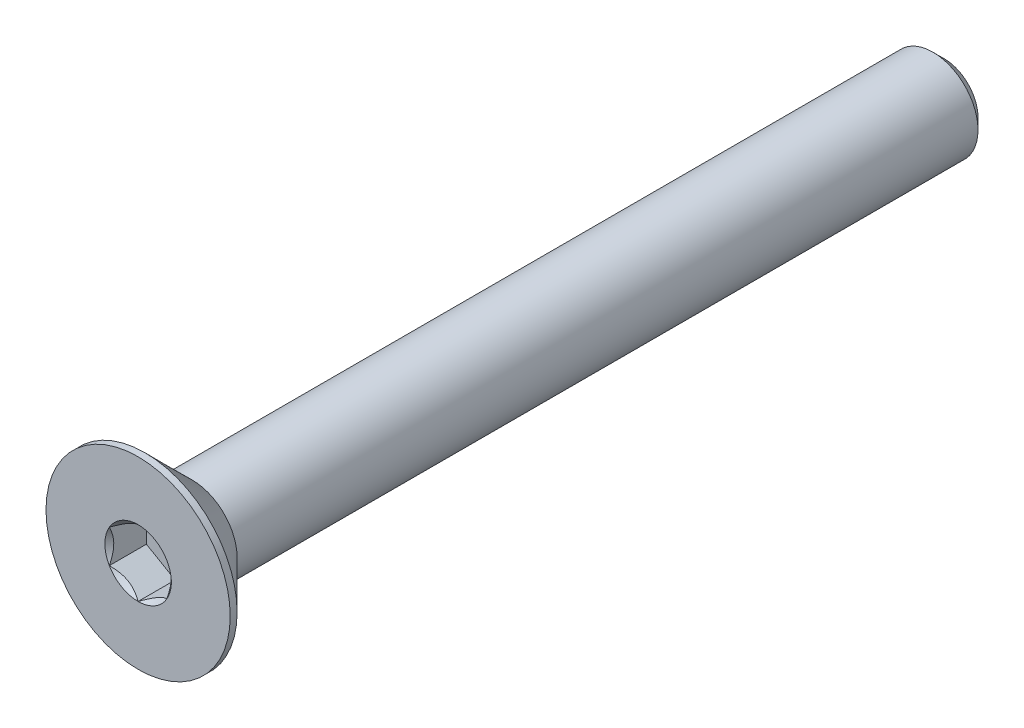
ISO-10303-21;
HEADER;
FILE_DESCRIPTION(('STEP AP214'),'2;1');
FILE_NAME('part.step','',(''),(''),'','','');
FILE_SCHEMA(('AUTOMOTIVE_DESIGN { 1 0 10303 214 1 1 1 1 }'));
ENDSEC;
DATA;
#1=APPLICATION_CONTEXT('core data for automotive mechanical design processes');
#2=APPLICATION_PROTOCOL_DEFINITION('international standard','automotive_design',2000,#1);
#3=PRODUCT_CONTEXT('',#1,'mechanical');
#4=PRODUCT('Part','Part','',(#3));
#5=PRODUCT_RELATED_PRODUCT_CATEGORY('part','',(#4));
#6=PRODUCT_DEFINITION_FORMATION('','',#4);
#7=PRODUCT_DEFINITION_CONTEXT('part definition',#1,'design');
#8=PRODUCT_DEFINITION('design','',#6,#7);
#9=PRODUCT_DEFINITION_SHAPE('','',#8);
#10=(LENGTH_UNIT() NAMED_UNIT(*) SI_UNIT(.MILLI.,.METRE.));
#11=(NAMED_UNIT(*) PLANE_ANGLE_UNIT() SI_UNIT($,.RADIAN.));
#12=(NAMED_UNIT(*) SI_UNIT($,.STERADIAN.) SOLID_ANGLE_UNIT());
#13=UNCERTAINTY_MEASURE_WITH_UNIT(LENGTH_MEASURE(1.E-05),#10,'distance_accuracy_value','');
#14=(GEOMETRIC_REPRESENTATION_CONTEXT(3) GLOBAL_UNCERTAINTY_ASSIGNED_CONTEXT((#13)) GLOBAL_UNIT_ASSIGNED_CONTEXT((#10,
#11,#12)) REPRESENTATION_CONTEXT('',''));
#15=CARTESIAN_POINT('',(0.,0.,0.));
#16=DIRECTION('',(0.,0.,1.));
#17=DIRECTION('',(1.,0.,0.));
#18=AXIS2_PLACEMENT_3D('',#15,#16,#17);
#19=CARTESIAN_POINT('',(1.25,-0.721687836487033,-1.61));
#20=DIRECTION('',(0.,0.,1.));
#21=DIRECTION('',(1.,0.,0.));
#22=AXIS2_PLACEMENT_3D('',#19,#20,#21);
#23=PLANE('',#22);
#24=DIRECTION('',(0.,1.,0.));
#25=VECTOR('',#24,1.);
#26=CARTESIAN_POINT('',(-1.25,0.721687836487033,-1.61));
#27=LINE('',#26,#25);
#28=CARTESIAN_POINT('',(-1.25,0.721687836487032,-1.61));
#29=VERTEX_POINT('',#28);
#30=CARTESIAN_POINT('',(-1.25,-0.721687836487031,-1.61));
#31=VERTEX_POINT('',#30);
#32=EDGE_CURVE('E83',#29,#31,#27,.F.);
#33=ORIENTED_EDGE('',*,*,#32,.T.);
#34=DIRECTION('',(0.866025403784439,-0.5,0.));
#35=VECTOR('',#34,1.);
#36=CARTESIAN_POINT('',(-1.25,-0.721687836487031,-1.61));
#37=LINE('',#36,#35);
#38=CARTESIAN_POINT('',(0.,-1.44337567297406,-1.61));
#39=VERTEX_POINT('',#38);
#40=EDGE_CURVE('E85',#31,#39,#37,.T.);
#41=ORIENTED_EDGE('',*,*,#40,.T.);
#42=DIRECTION('',(0.866025403784439,0.5,0.));
#43=VECTOR('',#42,1.);
#44=CARTESIAN_POINT('',(0.,-1.44337567297406,-1.61));
#45=LINE('',#44,#43);
#46=CARTESIAN_POINT('',(1.25,-0.721687836487033,-1.61));
#47=VERTEX_POINT('',#46);
#48=EDGE_CURVE('E86',#39,#47,#45,.T.);
#49=ORIENTED_EDGE('',*,*,#48,.T.);
#50=DIRECTION('',(0.,1.,0.));
#51=VECTOR('',#50,1.);
#52=CARTESIAN_POINT('',(1.25,-0.721687836487033,-1.61));
#53=LINE('',#52,#51);
#54=CARTESIAN_POINT('',(1.25,0.721687836487033,-1.61));
#55=VERTEX_POINT('',#54);
#56=EDGE_CURVE('E72',#47,#55,#53,.T.);
#57=ORIENTED_EDGE('',*,*,#56,.T.);
#58=DIRECTION('',(-0.866025403784439,0.5,0.));
#59=VECTOR('',#58,1.);
#60=CARTESIAN_POINT('',(1.25,0.721687836487033,-1.61));
#61=LINE('',#60,#59);
#62=CARTESIAN_POINT('',(0.,1.44337567297406,-1.61));
#63=VERTEX_POINT('',#62);
#64=EDGE_CURVE('E111',#55,#63,#61,.T.);
#65=ORIENTED_EDGE('',*,*,#64,.T.);
#66=DIRECTION('',(-0.866025403784439,-0.5,0.));
#67=VECTOR('',#66,1.);
#68=CARTESIAN_POINT('',(0.,1.44337567297406,-1.61));
#69=LINE('',#68,#67);
#70=EDGE_CURVE('E116',#63,#29,#69,.T.);
#71=ORIENTED_EDGE('',*,*,#70,.T.);
#72=EDGE_LOOP('',(#33,#41,#49,#57,#65,#71));
#73=FACE_BOUND('',#72,.T.);
#74=ADVANCED_FACE('F17',(#73),#23,.T.);
#75=CARTESIAN_POINT('',(0.,-1.44337567297406,-1.61));
#76=DIRECTION('',(0.5,-0.866025403784439,0.));
#77=DIRECTION('',(0.866025403784439,0.5,0.));
#78=AXIS2_PLACEMENT_3D('',#75,#76,#77);
#79=PLANE('',#78);
#80=CARTESIAN_POINT('',(-1.59632884925651E-12,-1.44337567297499,-2.2685841326118E-12));
#81=CARTESIAN_POINT('',(0.0429631084916685,-1.41857091072118,-0.0247809602853262));
#82=CARTESIAN_POINT('',(0.0866445640224962,-1.39335141061186,-0.048106250542211));
#83=CARTESIAN_POINT('',(0.175715534518587,-1.34192626181896,-0.0908138610995848));
#84=CARTESIAN_POINT('',(0.221113515509129,-1.3157157252734,-0.110172426663462));
#85=CARTESIAN_POINT('',(0.312656311401012,-1.26286346742285,-0.143333784117164));
#86=CARTESIAN_POINT('',(0.358777825771211,-1.23623519868579,-0.15721990325138));
#87=CARTESIAN_POINT('',(0.452035961001519,-1.18239258920645,-0.178614098245694));
#88=CARTESIAN_POINT('',(0.499169734949581,-1.15517989212961,-0.186138138130082));
#89=CARTESIAN_POINT('',(0.580409086338886,-1.1082763307362,-0.192927172266352));
#90=CARTESIAN_POINT('',(0.6144098218632,-1.0886459969286,-0.19393181141306));
#91=CARTESIAN_POINT('',(0.682351445146423,-1.04941988243685,-0.192236504858619));
#92=CARTESIAN_POINT('',(0.716292318027035,-1.02982411034269,-0.189535740825175));
#93=CARTESIAN_POINT('',(0.783846380048843,-0.990821754449551,-0.180585751756811));
#94=CARTESIAN_POINT('',(0.817459234875116,-0.97141536366737,-0.174333227052609));
#95=CARTESIAN_POINT('',(0.884123738991266,-0.932926594270518,-0.158616460881214));
#96=CARTESIAN_POINT('',(0.917175141068937,-0.91384435838388,-0.149150841277129));
#97=CARTESIAN_POINT('',(1.00178642984031,-0.864994008035248,-0.121071668556236));
#98=CARTESIAN_POINT('',(1.05281387539248,-0.835533298609642,-0.100350655055702));
#99=CARTESIAN_POINT('',(1.15287239429478,-0.777764485786684,-0.0536764942537954));
#100=CARTESIAN_POINT('',(1.20190935742265,-0.749452981924566,-0.0277403788128118));
#101=CARTESIAN_POINT('',(1.25000000000159,-0.721687836486111,-2.26874925040989E-12));
#102=B_SPLINE_CURVE_WITH_KNOTS('',3,(#80,#81,#82,#83,#84,#85,#86,#87,#88,#89,#90,#91,#92,#93,
#94,#95,#96,#97,#98,#99,#100,#101),.UNSPECIFIED.,.F.,.F.,(4,2,2,2,2,2,2,2,2,2,4),(0.,
0.166478683193945,0.333926926769032,0.498716658424013,0.663091654503517,0.780745575390526,
0.89842548413854,1.01621489951224,1.13405490022132,1.32111591628309,1.5075756576265),.UNSPECIFIED.);
#103=CARTESIAN_POINT('',(0.,-1.44337567297566,-1.5951974611112E-12));
#104=VERTEX_POINT('',#103);
#105=CARTESIAN_POINT('',(1.2500000000008,-0.721687836489762,-1.1344037528383E-12));
#106=VERTEX_POINT('',#105);
#107=EDGE_CURVE('E20',#104,#106,#102,.T.);
#108=ORIENTED_EDGE('',*,*,#107,.T.);
#109=DIRECTION('',(0.,0.,1.));
#110=VECTOR('',#109,1.);
#111=CARTESIAN_POINT('',(1.25,-0.721687836487033,-1.61));
#112=LINE('',#111,#110);
#113=EDGE_CURVE('E91',#106,#47,#112,.F.);
#114=ORIENTED_EDGE('',*,*,#113,.T.);
#115=ORIENTED_EDGE('',*,*,#48,.F.);
#116=DIRECTION('',(0.,0.,1.));
#117=VECTOR('',#116,1.);
#118=CARTESIAN_POINT('',(0.,-1.44337567297406,-1.61));
#119=LINE('',#118,#117);
#120=EDGE_CURVE('E59',#39,#104,#119,.T.);
#121=ORIENTED_EDGE('',*,*,#120,.T.);
#122=EDGE_LOOP('',(#108,#114,#115,#121));
#123=FACE_BOUND('',#122,.T.);
#124=ADVANCED_FACE('F90',(#123),#79,.F.);
#125=CARTESIAN_POINT('',(-1.25,-0.721687836487031,-1.61));
#126=DIRECTION('',(-0.5,-0.866025403784439,0.));
#127=DIRECTION('',(0.866025403784439,-0.5,0.));
#128=AXIS2_PLACEMENT_3D('',#125,#126,#127);
#129=PLANE('',#128);
#130=CARTESIAN_POINT('',(-1.2500000000016,-0.721687836486109,-2.26772839276623E-12));
#131=CARTESIAN_POINT('',(-1.20703689150833,-0.746492598739919,-0.0247809602853254));
#132=CARTESIAN_POINT('',(-1.1633554359775,-0.771712098849237,-0.0481062505422104));
#133=CARTESIAN_POINT('',(-1.07428446548141,-0.823137247642137,-0.0908138610995846));
#134=CARTESIAN_POINT('',(-1.02888648449087,-0.849347784187692,-0.110172426663462));
#135=CARTESIAN_POINT('',(-0.937343688598988,-0.902200042038241,-0.143333784117165));
#136=CARTESIAN_POINT('',(-0.891222174228788,-0.928828310775309,-0.15721990325138));
#137=CARTESIAN_POINT('',(-0.79796403899848,-0.98267092025465,-0.178614098245695));
#138=CARTESIAN_POINT('',(-0.750830265050418,-1.00988361733149,-0.186138138130082));
#139=CARTESIAN_POINT('',(-0.669590913661113,-1.05678717872489,-0.192927172266352));
#140=CARTESIAN_POINT('',(-0.635590178136799,-1.0764175125325,-0.193931811413061));
#141=CARTESIAN_POINT('',(-0.567648554853576,-1.11564362702425,-0.192236504858619));
#142=CARTESIAN_POINT('',(-0.533707681972964,-1.1352393991184,-0.189535740825175));
#143=CARTESIAN_POINT('',(-0.466153619951155,-1.17424175501155,-0.180585751756811));
#144=CARTESIAN_POINT('',(-0.432540765124883,-1.19364814579373,-0.174333227052609));
#145=CARTESIAN_POINT('',(-0.365876261008733,-1.23213691519058,-0.158616460881214));
#146=CARTESIAN_POINT('',(-0.332824858931062,-1.25121915107722,-0.149150841277129));
#147=CARTESIAN_POINT('',(-0.248213570159689,-1.30006950142585,-0.121071668556236));
#148=CARTESIAN_POINT('',(-0.197186124607517,-1.32953021085146,-0.100350655055702));
#149=CARTESIAN_POINT('',(-0.0971276057052169,-1.38729902367441,-0.0536764942537953));
#150=CARTESIAN_POINT('',(-0.0480906425773456,-1.41561052753653,-0.0277403788128117));
#151=CARTESIAN_POINT('',(1.59649182397064E-12,-1.44337567297499,-2.26862875383583E-12));
#152=B_SPLINE_CURVE_WITH_KNOTS('',3,(#130,#131,#132,#133,#134,#135,#136,#137,#138,#139,#140,
#141,#142,#143,#144,#145,#146,#147,#148,#149,#150,#151),.UNSPECIFIED.,.F.,.F.,(4,2,2,2,2,2,2,2,
2,2,4),(0.,0.166478683193946,0.333926926769033,0.498716658424015,0.66309165450352,
0.780745575390529,0.898425484138542,1.01621489951224,1.13405490022132,1.3211159162831,
1.5075756576265),.UNSPECIFIED.);
#153=CARTESIAN_POINT('',(-1.25000000000138,-0.721687836487828,-1.59464569232191E-12));
#154=VERTEX_POINT('',#153);
#155=EDGE_CURVE('E95',#154,#104,#152,.T.);
#156=ORIENTED_EDGE('',*,*,#155,.T.);
#157=ORIENTED_EDGE('',*,*,#120,.F.);
#158=ORIENTED_EDGE('',*,*,#40,.F.);
#159=DIRECTION('',(0.,0.,1.));
#160=VECTOR('',#159,1.);
#161=CARTESIAN_POINT('',(-1.25,-0.721687836487031,-1.61));
#162=LINE('',#161,#160);
#163=EDGE_CURVE('E97',#31,#154,#162,.T.);
#164=ORIENTED_EDGE('',*,*,#163,.T.);
#165=EDGE_LOOP('',(#156,#157,#158,#164));
#166=FACE_BOUND('',#165,.T.);
#167=ADVANCED_FACE('F93',(#166),#129,.F.);
#168=CARTESIAN_POINT('',(-1.25,0.721687836487033,-1.61));
#169=DIRECTION('',(-1.,0.,0.));
#170=DIRECTION('',(0.,0.,1.));
#171=AXIS2_PLACEMENT_3D('',#168,#169,#170);
#172=PLANE('',#171);
#173=CARTESIAN_POINT('',(-1.25,0.721687836488875,-2.26707190937663E-12));
#174=CARTESIAN_POINT('',(-1.25,0.672078311968734,-0.0247809602843515));
#175=CARTESIAN_POINT('',(-1.25,0.621639311737501,-0.0481062505397474));
#176=CARTESIAN_POINT('',(-1.25,0.518789014126518,-0.0908138610927559));
#177=CARTESIAN_POINT('',(-1.25,0.466367941022824,-0.110172426653753));
#178=CARTESIAN_POINT('',(-1.25,0.360663425297221,-0.143333784099995));
#179=CARTESIAN_POINT('',(-1.25,0.307406887811172,-0.157219903229681));
#180=CARTESIAN_POINT('',(-1.25,0.199721668829271,-0.178614098213361));
#181=CARTESIAN_POINT('',(-1.25,0.145296274664291,-0.186138138091645));
#182=CARTESIAN_POINT('',(-1.25,0.0514891518512712,-0.192927172217058));
#183=CARTESIAN_POINT('',(-1.25,0.0122284842208852,-0.19393181135857));
#184=CARTESIAN_POINT('',(-1.25,-0.0662237447923836,-0.19223650479206));
#185=CARTESIAN_POINT('',(-1.25,-0.10541528899529,-0.189535740751741));
#186=CARTESIAN_POINT('',(-1.25,-0.183420000810115,-0.180585751668415));
#187=CARTESIAN_POINT('',(-1.25,-0.222232782388411,-0.174333226956124));
#188=CARTESIAN_POINT('',(-1.25,-0.299210321209361,-0.158616460767832));
#189=CARTESIAN_POINT('',(-1.25,-0.337374792995946,-0.14915084115494));
#190=CARTESIAN_POINT('',(-1.25,-0.43507549364919,-0.121071668433227));
#191=CARTESIAN_POINT('',(-1.25,-0.493996912445358,-0.100350654949517));
#192=CARTESIAN_POINT('',(-1.25,-0.609534537985813,-0.0536764941931683));
#193=CARTESIAN_POINT('',(-1.25,-0.66615754565963,-0.0277403787809137));
#194=CARTESIAN_POINT('',(-1.25,-0.721687836488873,-2.26787846144495E-12));
#195=B_SPLINE_CURVE_WITH_KNOTS('',3,(#173,#174,#175,#176,#177,#178,#179,#180,#181,#182,#183,
#184,#185,#186,#187,#188,#189,#190,#191,#192,#193,#194),.UNSPECIFIED.,.F.,.F.,(4,2,2,2,2,2,2,2,
2,2,4),(0.,0.166478683226287,0.333926926833723,0.498716658519756,0.663091654630285,
0.780745575562284,0.89842548435534,1.01621489977414,1.13405490052833,1.3211159164188,
1.50757565759031),.UNSPECIFIED.);
#196=CARTESIAN_POINT('',(-1.25000000000138,0.72168783648783,-1.59446391689966E-12));
#197=VERTEX_POINT('',#196);
#198=EDGE_CURVE('E195',#197,#154,#195,.T.);
#199=ORIENTED_EDGE('',*,*,#198,.T.);
#200=ORIENTED_EDGE('',*,*,#163,.F.);
#201=ORIENTED_EDGE('',*,*,#32,.F.);
#202=DIRECTION('',(0.,0.,1.));
#203=VECTOR('',#202,1.);
#204=CARTESIAN_POINT('',(-1.25,0.721687836487032,-1.61));
#205=LINE('',#204,#203);
#206=EDGE_CURVE('E113',#29,#197,#205,.T.);
#207=ORIENTED_EDGE('',*,*,#206,.T.);
#208=EDGE_LOOP('',(#199,#200,#201,#207));
#209=FACE_BOUND('',#208,.T.);
#210=ADVANCED_FACE('F205',(#209),#172,.F.);
#211=CARTESIAN_POINT('',(0.,1.44337567297406,-1.61));
#212=DIRECTION('',(-0.5,0.866025403784439,0.));
#213=DIRECTION('',(-0.866025403784439,-0.5,0.));
#214=AXIS2_PLACEMENT_3D('',#211,#212,#213);
#215=PLANE('',#214);
#216=CARTESIAN_POINT('',(1.59613398999842E-12,1.44337567297499,-2.26833931174844E-12));
#217=CARTESIAN_POINT('',(-0.0429631084916687,1.41857091072118,-0.024780960285326));
#218=CARTESIAN_POINT('',(-0.0866445640224964,1.39335141061186,-0.0481062505422108));
#219=CARTESIAN_POINT('',(-0.175715534518587,1.34192626181896,-0.0908138610995847));
#220=CARTESIAN_POINT('',(-0.22111351550913,1.3157157252734,-0.110172426663462));
#221=CARTESIAN_POINT('',(-0.312656311401012,1.26286346742285,-0.143333784117164));
#222=CARTESIAN_POINT('',(-0.358777825771212,1.23623519868579,-0.15721990325138));
#223=CARTESIAN_POINT('',(-0.45203596100152,1.18239258920645,-0.178614098245694));
#224=CARTESIAN_POINT('',(-0.499169734949581,1.15517989212961,-0.186138138130082));
#225=CARTESIAN_POINT('',(-0.580409086338886,1.1082763307362,-0.192927172266352));
#226=CARTESIAN_POINT('',(-0.6144098218632,1.0886459969286,-0.19393181141306));
#227=CARTESIAN_POINT('',(-0.682351445146423,1.04941988243685,-0.192236504858619));
#228=CARTESIAN_POINT('',(-0.716292318027036,1.02982411034269,-0.189535740825175));
#229=CARTESIAN_POINT('',(-0.783846380048844,0.99082175444955,-0.180585751756811));
#230=CARTESIAN_POINT('',(-0.817459234875117,0.97141536366737,-0.174333227052609));
#231=CARTESIAN_POINT('',(-0.884123738991267,0.932926594270518,-0.158616460881213));
#232=CARTESIAN_POINT('',(-0.917175141068938,0.91384435838388,-0.149150841277128));
#233=CARTESIAN_POINT('',(-1.00178642984031,0.864994008035247,-0.121071668556235));
#234=CARTESIAN_POINT('',(-1.05281387539248,0.835533298609641,-0.100350655055701));
#235=CARTESIAN_POINT('',(-1.15287239429478,0.777764485786683,-0.0536764942537944));
#236=CARTESIAN_POINT('',(-1.20190935742265,0.749452981924565,-0.0277403788128108));
#237=CARTESIAN_POINT('',(-1.2500000000016,0.721687836486111,-2.26788103424833E-12));
#238=B_SPLINE_CURVE_WITH_KNOTS('',3,(#216,#217,#218,#219,#220,#221,#222,#223,#224,#225,#226,
#227,#228,#229,#230,#231,#232,#233,#234,#235,#236,#237),.UNSPECIFIED.,.F.,.F.,(4,2,2,2,2,2,2,2,
2,2,4),(0.,0.166478683193945,0.333926926769032,0.498716658424013,0.663091654503518,
0.780745575390527,0.898425484138541,1.01621489951224,1.13405490022132,1.3211159162831,
1.5075756576265),.UNSPECIFIED.);
#239=CARTESIAN_POINT('',(0.,1.44337567297566,-1.59483068508603E-12));
#240=VERTEX_POINT('',#239);
#241=EDGE_CURVE('E187',#240,#197,#238,.T.);
#242=ORIENTED_EDGE('',*,*,#241,.T.);
#243=ORIENTED_EDGE('',*,*,#206,.F.);
#244=ORIENTED_EDGE('',*,*,#70,.F.);
#245=DIRECTION('',(0.,0.,1.));
#246=VECTOR('',#245,1.);
#247=CARTESIAN_POINT('',(0.,1.44337567297406,-1.61));
#248=LINE('',#247,#246);
#249=EDGE_CURVE('E108',#63,#240,#248,.T.);
#250=ORIENTED_EDGE('',*,*,#249,.T.);
#251=EDGE_LOOP('',(#242,#243,#244,#250));
#252=FACE_BOUND('',#251,.T.);
#253=ADVANCED_FACE('F201',(#252),#215,.F.);
#254=CARTESIAN_POINT('',(1.25,0.721687836487033,-1.61));
#255=DIRECTION('',(0.5,0.866025403784439,0.));
#256=DIRECTION('',(-0.866025403784439,0.5,0.));
#257=AXIS2_PLACEMENT_3D('',#254,#255,#256);
#258=PLANE('',#257);
#259=CARTESIAN_POINT('',(1.2500000000016,0.721687836486112,-2.26853696452564E-12));
#260=CARTESIAN_POINT('',(1.20703689150833,0.746492598739921,-0.0247809602853261));
#261=CARTESIAN_POINT('',(1.1633554359775,0.771712098849239,-0.0481062505422108));
#262=CARTESIAN_POINT('',(1.07428446548141,0.823137247642138,-0.0908138610995846));
#263=CARTESIAN_POINT('',(1.02888648449087,0.849347784187693,-0.110172426663462));
#264=CARTESIAN_POINT('',(0.937343688598987,0.902200042038243,-0.143333784117164));
#265=CARTESIAN_POINT('',(0.891222174228788,0.92882831077531,-0.15721990325138));
#266=CARTESIAN_POINT('',(0.79796403899848,0.982670920254651,-0.178614098245694));
#267=CARTESIAN_POINT('',(0.750830265050419,1.00988361733149,-0.186138138130081));
#268=CARTESIAN_POINT('',(0.669590913661114,1.05678717872489,-0.192927172266351));
#269=CARTESIAN_POINT('',(0.6355901781368,1.0764175125325,-0.19393181141306));
#270=CARTESIAN_POINT('',(0.567648554853577,1.11564362702425,-0.192236504858619));
#271=CARTESIAN_POINT('',(0.533707681972964,1.1352393991184,-0.189535740825174));
#272=CARTESIAN_POINT('',(0.466153619951156,1.17424175501155,-0.180585751756811));
#273=CARTESIAN_POINT('',(0.432540765124883,1.19364814579373,-0.174333227052609));
#274=CARTESIAN_POINT('',(0.365876261008733,1.23213691519058,-0.158616460881213));
#275=CARTESIAN_POINT('',(0.332824858931062,1.25121915107722,-0.149150841277128));
#276=CARTESIAN_POINT('',(0.24821357015969,1.30006950142585,-0.121071668556235));
#277=CARTESIAN_POINT('',(0.197186124607517,1.32953021085146,-0.100350655055702));
#278=CARTESIAN_POINT('',(0.0971276057052174,1.38729902367441,-0.0536764942537946));
#279=CARTESIAN_POINT('',(0.0480906425773461,1.41561052753653,-0.0277403788128111));
#280=CARTESIAN_POINT('',(-1.59614565415006E-12,1.44337567297499,-2.26815881940463E-12));
#281=B_SPLINE_CURVE_WITH_KNOTS('',3,(#259,#260,#261,#262,#263,#264,#265,#266,#267,#268,#269,
#270,#271,#272,#273,#274,#275,#276,#277,#278,#279,#280),.UNSPECIFIED.,.F.,.F.,(4,2,2,2,2,2,2,2,
2,2,4),(0.,0.166478683193945,0.333926926769031,0.498716658424013,0.663091654503516,
0.780745575390525,0.898425484138539,1.01621489951224,1.13405490022132,1.32111591628309,
1.5075756576265),.UNSPECIFIED.);
#282=CARTESIAN_POINT('',(1.25000000000138,0.721687836487831,-1.59505075853978E-12));
#283=VERTEX_POINT('',#282);
#284=EDGE_CURVE('E157',#283,#240,#281,.T.);
#285=ORIENTED_EDGE('',*,*,#284,.T.);
#286=ORIENTED_EDGE('',*,*,#249,.F.);
#287=ORIENTED_EDGE('',*,*,#64,.F.);
#288=DIRECTION('',(0.,0.,1.));
#289=VECTOR('',#288,1.);
#290=CARTESIAN_POINT('',(1.25,0.721687836487033,-1.61));
#291=LINE('',#290,#289);
#292=EDGE_CURVE('E40',#55,#283,#291,.T.);
#293=ORIENTED_EDGE('',*,*,#292,.T.);
#294=EDGE_LOOP('',(#285,#286,#287,#293));
#295=FACE_BOUND('',#294,.T.);
#296=ADVANCED_FACE('F204',(#295),#258,.F.);
#297=CARTESIAN_POINT('',(1.25,-0.721687836487033,-1.61));
#298=DIRECTION('',(1.,0.,0.));
#299=DIRECTION('',(0.,1.,0.));
#300=AXIS2_PLACEMENT_3D('',#297,#298,#299);
#301=PLANE('',#300);
#302=CARTESIAN_POINT('',(1.25,-0.721687836488877,-2.26868388815891E-12));
#303=CARTESIAN_POINT('',(1.25,-0.672078311968736,-0.0247809602843532));
#304=CARTESIAN_POINT('',(1.25,-0.621639311737502,-0.0481062505397492));
#305=CARTESIAN_POINT('',(1.25,-0.51878901412652,-0.0908138610927579));
#306=CARTESIAN_POINT('',(1.25,-0.466367941022825,-0.110172426653756));
#307=CARTESIAN_POINT('',(1.25,-0.360663425297223,-0.143333784099998));
#308=CARTESIAN_POINT('',(1.25,-0.307406887811173,-0.157219903229684));
#309=CARTESIAN_POINT('',(1.25,-0.199721668829271,-0.178614098213363));
#310=CARTESIAN_POINT('',(1.25,-0.145296274664292,-0.186138138091648));
#311=CARTESIAN_POINT('',(1.25,-0.0514891518512717,-0.19292717221706));
#312=CARTESIAN_POINT('',(1.25,-0.0122284842208858,-0.193931811358573));
#313=CARTESIAN_POINT('',(1.25,0.0662237447923829,-0.192236504792063));
#314=CARTESIAN_POINT('',(1.25,0.105415288995289,-0.189535740751744));
#315=CARTESIAN_POINT('',(1.25,0.183420000810114,-0.180585751668418));
#316=CARTESIAN_POINT('',(1.25,0.22223278238841,-0.174333226956126));
#317=CARTESIAN_POINT('',(1.25,0.299210321209359,-0.158616460767835));
#318=CARTESIAN_POINT('',(1.25,0.337374792995945,-0.149150841154943));
#319=CARTESIAN_POINT('',(1.25,0.43507549364919,-0.121071668433229));
#320=CARTESIAN_POINT('',(1.25,0.493996912445358,-0.100350654949519));
#321=CARTESIAN_POINT('',(1.25,0.609534537985814,-0.0536764941931697));
#322=CARTESIAN_POINT('',(1.25,0.666157545659632,-0.0277403787809148));
#323=CARTESIAN_POINT('',(1.25,0.721687836488876,-2.26852812832509E-12));
#324=B_SPLINE_CURVE_WITH_KNOTS('',3,(#302,#303,#304,#305,#306,#307,#308,#309,#310,#311,#312,
#313,#314,#315,#316,#317,#318,#319,#320,#321,#322,#323),.UNSPECIFIED.,.F.,.F.,(4,2,2,2,2,2,2,2,
2,2,4),(0.,0.166478683226287,0.333926926833724,0.498716658519757,0.663091654630287,
0.780745575562285,0.898425484355342,1.01621489977414,1.13405490052833,1.3211159164188,
1.50757565759032),.UNSPECIFIED.);
#325=EDGE_CURVE('E149',#106,#283,#324,.T.);
#326=ORIENTED_EDGE('',*,*,#325,.T.);
#327=ORIENTED_EDGE('',*,*,#292,.F.);
#328=ORIENTED_EDGE('',*,*,#56,.F.);
#329=ORIENTED_EDGE('',*,*,#113,.F.);
#330=EDGE_LOOP('',(#326,#327,#328,#329));
#331=FACE_BOUND('',#330,.T.);
#332=ADVANCED_FACE('F165',(#331),#301,.F.);
#333=CARTESIAN_POINT('',(0.,0.,-5.6843418860808E-11));
#334=DIRECTION('',(0.,0.,1.));
#335=DIRECTION('',(1.,0.,0.));
#336=AXIS2_PLACEMENT_3D('',#333,#334,#335);
#337=CONICAL_SURFACE('',#336,1.44337567292041,0.78539816325135);
#338=ORIENTED_EDGE('',*,*,#107,.F.);
#339=CARTESIAN_POINT('',(0.,0.,0.));
#340=DIRECTION('',(0.,0.,1.));
#341=DIRECTION('',(1.,0.,0.));
#342=AXIS2_PLACEMENT_3D('',#339,#340,#341);
#343=CIRCLE('',#342,1.44337567297725);
#344=EDGE_CURVE('E146',#106,#104,#343,.F.);
#345=ORIENTED_EDGE('',*,*,#344,.F.);
#346=EDGE_LOOP('',(#338,#345));
#347=FACE_BOUND('',#346,.T.);
#348=ADVANCED_FACE('F222',(#347),#337,.F.);
#349=CARTESIAN_POINT('',(0.,0.,-5.6843418860808E-11));
#350=DIRECTION('',(0.,0.,1.));
#351=DIRECTION('',(1.,0.,0.));
#352=AXIS2_PLACEMENT_3D('',#349,#350,#351);
#353=CONICAL_SURFACE('',#352,1.44337567292041,0.78539816325135);
#354=ORIENTED_EDGE('',*,*,#155,.F.);
#355=CARTESIAN_POINT('',(0.,0.,0.));
#356=DIRECTION('',(0.,0.,1.));
#357=DIRECTION('',(1.,0.,0.));
#358=AXIS2_PLACEMENT_3D('',#355,#356,#357);
#359=CIRCLE('',#358,1.44337567297725);
#360=EDGE_CURVE('E143',#104,#154,#359,.F.);
#361=ORIENTED_EDGE('',*,*,#360,.F.);
#362=EDGE_LOOP('',(#354,#361));
#363=FACE_BOUND('',#362,.T.);
#364=ADVANCED_FACE('F219',(#363),#353,.F.);
#365=CARTESIAN_POINT('',(0.,0.,-5.6843418860808E-11));
#366=DIRECTION('',(0.,0.,1.));
#367=DIRECTION('',(1.,0.,0.));
#368=AXIS2_PLACEMENT_3D('',#365,#366,#367);
#369=CONICAL_SURFACE('',#368,1.44337567292041,0.785398163397448);
#370=ORIENTED_EDGE('',*,*,#198,.F.);
#371=CARTESIAN_POINT('',(0.,0.,0.));
#372=DIRECTION('',(0.,0.,1.));
#373=DIRECTION('',(1.,0.,0.));
#374=AXIS2_PLACEMENT_3D('',#371,#372,#373);
#375=CIRCLE('',#374,1.44337567297725);
#376=EDGE_CURVE('E140',#154,#197,#375,.F.);
#377=ORIENTED_EDGE('',*,*,#376,.F.);
#378=EDGE_LOOP('',(#370,#377));
#379=FACE_BOUND('',#378,.T.);
#380=ADVANCED_FACE('F183',(#379),#369,.F.);
#381=CARTESIAN_POINT('',(0.,0.,-5.6843418860808E-11));
#382=DIRECTION('',(0.,0.,1.));
#383=DIRECTION('',(1.,0.,0.));
#384=AXIS2_PLACEMENT_3D('',#381,#382,#383);
#385=CONICAL_SURFACE('',#384,1.44337567292041,0.78539816325135);
#386=ORIENTED_EDGE('',*,*,#241,.F.);
#387=CARTESIAN_POINT('',(0.,0.,0.));
#388=DIRECTION('',(0.,0.,1.));
#389=DIRECTION('',(1.,0.,0.));
#390=AXIS2_PLACEMENT_3D('',#387,#388,#389);
#391=CIRCLE('',#390,1.44337567297725);
#392=EDGE_CURVE('E137',#197,#240,#391,.F.);
#393=ORIENTED_EDGE('',*,*,#392,.F.);
#394=EDGE_LOOP('',(#386,#393));
#395=FACE_BOUND('',#394,.T.);
#396=ADVANCED_FACE('F178',(#395),#385,.F.);
#397=CARTESIAN_POINT('',(0.,0.,-5.6843418860808E-11));
#398=DIRECTION('',(0.,0.,1.));
#399=DIRECTION('',(1.,0.,0.));
#400=AXIS2_PLACEMENT_3D('',#397,#398,#399);
#401=CONICAL_SURFACE('',#400,1.44337567292041,0.78539816325135);
#402=ORIENTED_EDGE('',*,*,#284,.F.);
#403=CARTESIAN_POINT('',(0.,0.,0.));
#404=DIRECTION('',(0.,0.,1.));
#405=DIRECTION('',(1.,0.,0.));
#406=AXIS2_PLACEMENT_3D('',#403,#404,#405);
#407=CIRCLE('',#406,1.44337567297725);
#408=EDGE_CURVE('E134',#240,#283,#407,.F.);
#409=ORIENTED_EDGE('',*,*,#408,.F.);
#410=EDGE_LOOP('',(#402,#409));
#411=FACE_BOUND('',#410,.T.);
#412=ADVANCED_FACE('F172',(#411),#401,.F.);
#413=CARTESIAN_POINT('',(0.,0.,-5.6843418860808E-11));
#414=DIRECTION('',(0.,0.,1.));
#415=DIRECTION('',(1.,0.,0.));
#416=AXIS2_PLACEMENT_3D('',#413,#414,#415);
#417=CONICAL_SURFACE('',#416,1.44337567292041,0.785398163397448);
#418=CARTESIAN_POINT('',(0.,0.,0.));
#419=DIRECTION('',(0.,0.,1.));
#420=DIRECTION('',(1.,0.,0.));
#421=AXIS2_PLACEMENT_3D('',#418,#419,#420);
#422=CIRCLE('',#421,1.44337567297725);
#423=EDGE_CURVE('E131',#283,#106,#422,.F.);
#424=ORIENTED_EDGE('',*,*,#423,.F.);
#425=ORIENTED_EDGE('',*,*,#325,.F.);
#426=EDGE_LOOP('',(#424,#425));
#427=FACE_BOUND('',#426,.T.);
#428=ADVANCED_FACE('F167',(#427),#417,.F.);
#429=CARTESIAN_POINT('',(0.,-2.,0.));
#430=DIRECTION('',(0.,0.,1.));
#431=DIRECTION('',(0.,-1.,0.));
#432=AXIS2_PLACEMENT_3D('',#429,#430,#431);
#433=PLANE('',#432);
#434=ORIENTED_EDGE('',*,*,#408,.T.);
#435=ORIENTED_EDGE('',*,*,#423,.T.);
#436=ORIENTED_EDGE('',*,*,#344,.T.);
#437=ORIENTED_EDGE('',*,*,#360,.T.);
#438=ORIENTED_EDGE('',*,*,#376,.T.);
#439=ORIENTED_EDGE('',*,*,#392,.T.);
#440=EDGE_LOOP('',(#434,#435,#436,#437,#438,#439));
#441=FACE_BOUND('',#440,.T.);
#442=CARTESIAN_POINT('',(0.,0.,0.));
#443=DIRECTION('',(0.,0.,1.));
#444=DIRECTION('',(0.,-1.,0.));
#445=AXIS2_PLACEMENT_3D('',#442,#443,#444);
#446=CIRCLE('',#445,4.);
#447=CARTESIAN_POINT('',(0.,-4.,0.));
#448=VERTEX_POINT('',#447);
#449=EDGE_CURVE('E128',#448,#448,#446,.F.);
#450=ORIENTED_EDGE('',*,*,#449,.F.);
#451=EDGE_LOOP('',(#450));
#452=FACE_BOUND('',#451,.T.);
#453=ADVANCED_FACE('F171',(#441,#452),#433,.T.);
#454=CARTESIAN_POINT('',(0.,-2.,-35.));
#455=DIRECTION('',(0.,0.,-1.));
#456=DIRECTION('',(0.,1.,0.));
#457=AXIS2_PLACEMENT_3D('',#454,#455,#456);
#458=PLANE('',#457);
#459=CARTESIAN_POINT('',(0.,0.,-34.9999999999682));
#460=DIRECTION('',(0.,0.,1.));
#461=DIRECTION('',(1.,0.,0.));
#462=AXIS2_PLACEMENT_3D('',#459,#460,#461);
#463=CIRCLE('',#462,1.47500000002765);
#464=CARTESIAN_POINT('',(1.47500000002765,0.,-34.9999999999682));
#465=VERTEX_POINT('',#464);
#466=EDGE_CURVE('E124',#465,#465,#463,.T.);
#467=ORIENTED_EDGE('',*,*,#466,.F.);
#468=EDGE_LOOP('',(#467));
#469=FACE_BOUND('',#468,.T.);
#470=ADVANCED_FACE('F250',(#469),#458,.T.);
#471=CARTESIAN_POINT('',(0.,0.,0.));
#472=DIRECTION('',(0.,0.,1.));
#473=DIRECTION('',(0.,-1.,0.));
#474=AXIS2_PLACEMENT_3D('',#471,#472,#473);
#475=CYLINDRICAL_SURFACE('',#474,4.);
#476=CARTESIAN_POINT('',(0.,0.,-0.299999999981541));
#477=DIRECTION('',(0.,0.,1.));
#478=DIRECTION('',(0.,-1.,0.));
#479=AXIS2_PLACEMENT_3D('',#476,#477,#478);
#480=CIRCLE('',#479,4.0000000000191);
#481=CARTESIAN_POINT('',(0.,-4.0000000000191,-0.299999999981537));
#482=VERTEX_POINT('',#481);
#483=EDGE_CURVE('E127',#482,#482,#480,.F.);
#484=ORIENTED_EDGE('',*,*,#483,.F.);
#485=EDGE_LOOP('',(#484));
#486=FACE_BOUND('',#485,.T.);
#487=ORIENTED_EDGE('',*,*,#449,.T.);
#488=EDGE_LOOP('',(#487));
#489=FACE_BOUND('',#488,.T.);
#490=ADVANCED_FACE('F247',(#486,#489),#475,.T.);
#491=CARTESIAN_POINT('',(0.,0.,-34.5210000000407));
#492=DIRECTION('',(0.,0.,1.));
#493=DIRECTION('',(1.,0.,0.));
#494=AXIS2_PLACEMENT_3D('',#491,#492,#493);
#495=CONICAL_SURFACE('',#494,1.95399999989831,0.785398163338113);
#496=CARTESIAN_POINT('',(0.,0.,-34.5210000000001));
#497=DIRECTION('',(0.,0.,-1.));
#498=DIRECTION('',(0.,1.,0.));
#499=AXIS2_PLACEMENT_3D('',#496,#497,#498);
#500=CIRCLE('',#499,1.954);
#501=CARTESIAN_POINT('',(0.,1.954,-34.5210000000001));
#502=VERTEX_POINT('',#501);
#503=EDGE_CURVE('E31',#502,#502,#500,.F.);
#504=ORIENTED_EDGE('',*,*,#503,.F.);
#505=EDGE_LOOP('',(#504));
#506=FACE_BOUND('',#505,.T.);
#507=ORIENTED_EDGE('',*,*,#466,.T.);
#508=EDGE_LOOP('',(#507));
#509=FACE_BOUND('',#508,.T.);
#510=ADVANCED_FACE('F240',(#506,#509),#495,.T.);
#511=CARTESIAN_POINT('',(0.,0.,-0.299999999924697));
#512=DIRECTION('',(0.,0.,1.));
#513=DIRECTION('',(0.,-1.,0.));
#514=AXIS2_PLACEMENT_3D('',#511,#512,#513);
#515=CONICAL_SURFACE('',#514,4.00000000007594,0.785398163397449);
#516=CARTESIAN_POINT('',(0.,0.,-2.346));
#517=DIRECTION('',(0.,0.,-1.));
#518=DIRECTION('',(0.,1.,0.));
#519=AXIS2_PLACEMENT_3D('',#516,#517,#518);
#520=CIRCLE('',#519,1.954);
#521=CARTESIAN_POINT('',(0.,1.954,-2.346));
#522=VERTEX_POINT('',#521);
#523=EDGE_CURVE('E11',#522,#522,#520,.T.);
#524=ORIENTED_EDGE('',*,*,#523,.F.);
#525=EDGE_LOOP('',(#524));
#526=FACE_BOUND('',#525,.T.);
#527=ORIENTED_EDGE('',*,*,#483,.T.);
#528=EDGE_LOOP('',(#527));
#529=FACE_BOUND('',#528,.T.);
#530=ADVANCED_FACE('F234',(#526,#529),#515,.T.);
#531=CARTESIAN_POINT('',(0.,0.,-35.));
#532=DIRECTION('',(0.,0.,-1.));
#533=DIRECTION('',(0.,1.,0.));
#534=AXIS2_PLACEMENT_3D('',#531,#532,#533);
#535=CYLINDRICAL_SURFACE('',#534,1.954);
#536=ORIENTED_EDGE('',*,*,#523,.T.);
#537=EDGE_LOOP('',(#536));
#538=FACE_BOUND('',#537,.T.);
#539=ORIENTED_EDGE('',*,*,#503,.T.);
#540=EDGE_LOOP('',(#539));
#541=FACE_BOUND('',#540,.T.);
#542=ADVANCED_FACE('F232',(#538,#541),#535,.T.);
#543=CLOSED_SHELL('',(#74,#124,#167,#210,#253,#296,#332,#348,#364,#380,#396,#412,#428,#453,#470,
#490,#510,#530,#542));
#544=MANIFOLD_SOLID_BREP('B1',#543);
#545=ADVANCED_BREP_SHAPE_REPRESENTATION('',(#18,#544),#14);
#546=SHAPE_DEFINITION_REPRESENTATION(#9,#545);
ENDSEC;
END-ISO-10303-21;
